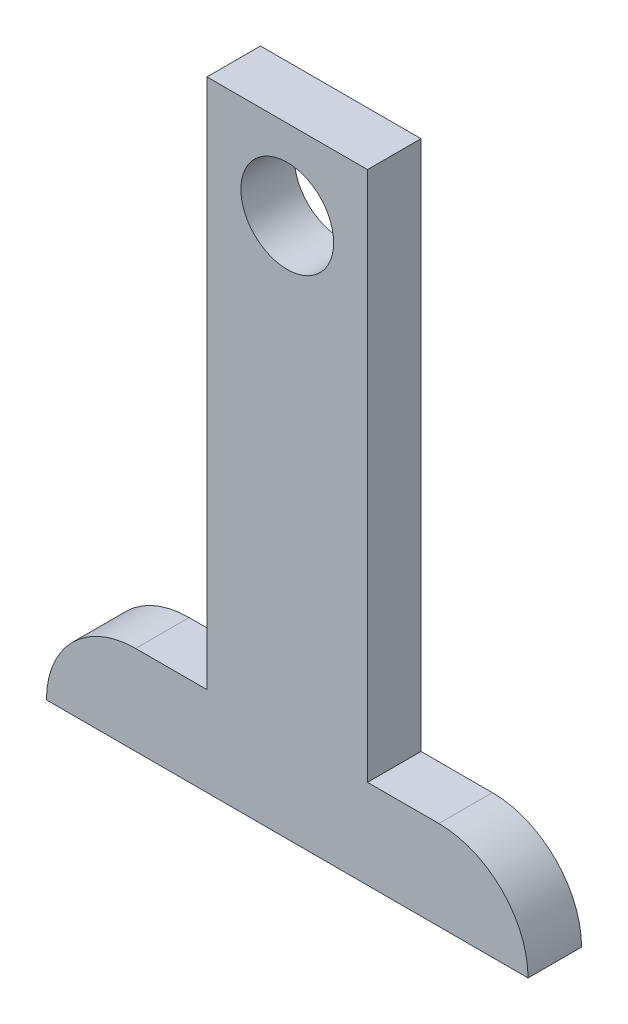
ISO-10303-21;
HEADER;
FILE_DESCRIPTION(('STEP AP214'),'2;1');
FILE_NAME('part.step','',(''),(''),'','','');
FILE_SCHEMA(('AUTOMOTIVE_DESIGN { 1 0 10303 214 1 1 1 1 }'));
ENDSEC;
DATA;
#1=APPLICATION_CONTEXT('core data for automotive mechanical design processes');
#2=APPLICATION_PROTOCOL_DEFINITION('international standard','automotive_design',2000,#1);
#3=PRODUCT_CONTEXT('',#1,'mechanical');
#4=PRODUCT('Part','Part','',(#3));
#5=PRODUCT_RELATED_PRODUCT_CATEGORY('part','',(#4));
#6=PRODUCT_DEFINITION_FORMATION('','',#4);
#7=PRODUCT_DEFINITION_CONTEXT('part definition',#1,'design');
#8=PRODUCT_DEFINITION('design','',#6,#7);
#9=PRODUCT_DEFINITION_SHAPE('','',#8);
#10=(LENGTH_UNIT() NAMED_UNIT(*) SI_UNIT(.MILLI.,.METRE.));
#11=(NAMED_UNIT(*) PLANE_ANGLE_UNIT() SI_UNIT($,.RADIAN.));
#12=(NAMED_UNIT(*) SI_UNIT($,.STERADIAN.) SOLID_ANGLE_UNIT());
#13=UNCERTAINTY_MEASURE_WITH_UNIT(LENGTH_MEASURE(1.E-05),#10,'distance_accuracy_value','');
#14=(GEOMETRIC_REPRESENTATION_CONTEXT(3) GLOBAL_UNCERTAINTY_ASSIGNED_CONTEXT((#13)) GLOBAL_UNIT_ASSIGNED_CONTEXT((#10,
#11,#12)) REPRESENTATION_CONTEXT('',''));
#15=CARTESIAN_POINT('',(0.,0.,0.));
#16=DIRECTION('',(0.,0.,1.));
#17=DIRECTION('',(1.,0.,0.));
#18=AXIS2_PLACEMENT_3D('',#15,#16,#17);
#19=CARTESIAN_POINT('',(0.,0.,3.));
#20=DIRECTION('',(0.,0.,-1.));
#21=DIRECTION('',(-1.,0.,0.));
#22=AXIS2_PLACEMENT_3D('',#19,#20,#21);
#23=PLANE('',#22);
#24=DIRECTION('',(1.,0.,0.));
#25=VECTOR('',#24,1.);
#26=CARTESIAN_POINT('',(-18.,-5.,3.));
#27=LINE('',#26,#25);
#28=CARTESIAN_POINT('',(-18.,-5.,3.));
#29=VERTEX_POINT('',#28);
#30=CARTESIAN_POINT('',(9.,-5.,3.));
#31=VERTEX_POINT('',#30);
#32=EDGE_CURVE('E142',#29,#31,#27,.T.);
#33=ORIENTED_EDGE('',*,*,#32,.T.);
#34=CARTESIAN_POINT('',(4.,-5.,3.));
#35=DIRECTION('',(0.,0.,-1.));
#36=DIRECTION('',(-1.,0.,0.));
#37=AXIS2_PLACEMENT_3D('',#34,#35,#36);
#38=CIRCLE('',#37,5.);
#39=CARTESIAN_POINT('',(4.,0.,3.));
#40=VERTEX_POINT('',#39);
#41=EDGE_CURVE('E11',#31,#40,#38,.F.);
#42=ORIENTED_EDGE('',*,*,#41,.T.);
#43=DIRECTION('',(-1.,0.,0.));
#44=VECTOR('',#43,1.);
#45=CARTESIAN_POINT('',(9.,0.,3.));
#46=LINE('',#45,#44);
#47=CARTESIAN_POINT('',(0.,0.,3.));
#48=VERTEX_POINT('',#47);
#49=EDGE_CURVE('E93',#40,#48,#46,.T.);
#50=ORIENTED_EDGE('',*,*,#49,.T.);
#51=DIRECTION('',(0.,1.,0.));
#52=VECTOR('',#51,1.);
#53=CARTESIAN_POINT('',(0.,0.,3.));
#54=LINE('',#53,#52);
#55=CARTESIAN_POINT('',(0.,29.75,3.));
#56=VERTEX_POINT('',#55);
#57=EDGE_CURVE('E96',#48,#56,#54,.T.);
#58=ORIENTED_EDGE('',*,*,#57,.T.);
#59=DIRECTION('',(-1.,0.,0.));
#60=VECTOR('',#59,1.);
#61=CARTESIAN_POINT('',(0.,29.75,3.));
#62=LINE('',#61,#60);
#63=CARTESIAN_POINT('',(-9.,29.75,3.));
#64=VERTEX_POINT('',#63);
#65=EDGE_CURVE('E109',#56,#64,#62,.T.);
#66=ORIENTED_EDGE('',*,*,#65,.T.);
#67=DIRECTION('',(0.,-1.,0.));
#68=VECTOR('',#67,1.);
#69=CARTESIAN_POINT('',(-9.,0.,3.));
#70=LINE('',#69,#68);
#71=CARTESIAN_POINT('',(-9.,0.,3.));
#72=VERTEX_POINT('',#71);
#73=EDGE_CURVE('E159',#64,#72,#70,.T.);
#74=ORIENTED_EDGE('',*,*,#73,.T.);
#75=DIRECTION('',(-1.,0.,0.));
#76=VECTOR('',#75,1.);
#77=CARTESIAN_POINT('',(-9.,0.,3.));
#78=LINE('',#77,#76);
#79=CARTESIAN_POINT('',(-13.,0.,3.));
#80=VERTEX_POINT('',#79);
#81=EDGE_CURVE('E146',#72,#80,#78,.T.);
#82=ORIENTED_EDGE('',*,*,#81,.T.);
#83=CARTESIAN_POINT('',(-13.,-5.,3.));
#84=DIRECTION('',(0.,0.,-1.));
#85=DIRECTION('',(-1.,0.,0.));
#86=AXIS2_PLACEMENT_3D('',#83,#84,#85);
#87=CIRCLE('',#86,5.);
#88=EDGE_CURVE('E124',#80,#29,#87,.F.);
#89=ORIENTED_EDGE('',*,*,#88,.T.);
#90=EDGE_LOOP('',(#33,#42,#50,#58,#66,#74,#82,#89));
#91=FACE_BOUND('',#90,.T.);
#92=CARTESIAN_POINT('',(-4.5,25.25,3.));
#93=DIRECTION('',(0.,0.,1.));
#94=DIRECTION('',(1.,0.,0.));
#95=AXIS2_PLACEMENT_3D('',#92,#93,#94);
#96=CIRCLE('',#95,2.6);
#97=CARTESIAN_POINT('',(-1.9,25.25,3.));
#98=VERTEX_POINT('',#97);
#99=EDGE_CURVE('E170',#98,#98,#96,.T.);
#100=ORIENTED_EDGE('',*,*,#99,.F.);
#101=EDGE_LOOP('',(#100));
#102=FACE_BOUND('',#101,.T.);
#103=ADVANCED_FACE('F33',(#91,#102),#23,.F.);
#104=CARTESIAN_POINT('',(0.,0.,0.));
#105=DIRECTION('',(0.,0.,-1.));
#106=DIRECTION('',(-1.,0.,0.));
#107=AXIS2_PLACEMENT_3D('',#104,#105,#106);
#108=PLANE('',#107);
#109=DIRECTION('',(-1.,0.,0.));
#110=VECTOR('',#109,1.);
#111=CARTESIAN_POINT('',(9.,0.,0.));
#112=LINE('',#111,#110);
#113=CARTESIAN_POINT('',(4.,0.,0.));
#114=VERTEX_POINT('',#113);
#115=CARTESIAN_POINT('',(0.,0.,0.));
#116=VERTEX_POINT('',#115);
#117=EDGE_CURVE('E113',#114,#116,#112,.T.);
#118=ORIENTED_EDGE('',*,*,#117,.F.);
#119=CARTESIAN_POINT('',(4.,-5.,0.));
#120=DIRECTION('',(0.,0.,-1.));
#121=DIRECTION('',(-1.,0.,0.));
#122=AXIS2_PLACEMENT_3D('',#119,#120,#121);
#123=CIRCLE('',#122,5.);
#124=CARTESIAN_POINT('',(9.,-5.,0.));
#125=VERTEX_POINT('',#124);
#126=EDGE_CURVE('E41',#114,#125,#123,.T.);
#127=ORIENTED_EDGE('',*,*,#126,.T.);
#128=DIRECTION('',(1.,0.,0.));
#129=VECTOR('',#128,1.);
#130=CARTESIAN_POINT('',(-18.,-5.,0.));
#131=LINE('',#130,#129);
#132=CARTESIAN_POINT('',(-18.,-5.,0.));
#133=VERTEX_POINT('',#132);
#134=EDGE_CURVE('E100',#133,#125,#131,.T.);
#135=ORIENTED_EDGE('',*,*,#134,.F.);
#136=CARTESIAN_POINT('',(-13.,-5.,0.));
#137=DIRECTION('',(0.,0.,-1.));
#138=DIRECTION('',(-1.,0.,0.));
#139=AXIS2_PLACEMENT_3D('',#136,#137,#138);
#140=CIRCLE('',#139,5.);
#141=CARTESIAN_POINT('',(-13.,0.,0.));
#142=VERTEX_POINT('',#141);
#143=EDGE_CURVE('E115',#133,#142,#140,.T.);
#144=ORIENTED_EDGE('',*,*,#143,.T.);
#145=DIRECTION('',(-1.,0.,0.));
#146=VECTOR('',#145,1.);
#147=CARTESIAN_POINT('',(-9.,0.,0.));
#148=LINE('',#147,#146);
#149=CARTESIAN_POINT('',(-9.,0.,0.));
#150=VERTEX_POINT('',#149);
#151=EDGE_CURVE('E140',#150,#142,#148,.T.);
#152=ORIENTED_EDGE('',*,*,#151,.F.);
#153=DIRECTION('',(0.,-1.,0.));
#154=VECTOR('',#153,1.);
#155=CARTESIAN_POINT('',(-9.,0.,0.));
#156=LINE('',#155,#154);
#157=CARTESIAN_POINT('',(-9.,29.75,0.));
#158=VERTEX_POINT('',#157);
#159=EDGE_CURVE('E158',#158,#150,#156,.T.);
#160=ORIENTED_EDGE('',*,*,#159,.F.);
#161=DIRECTION('',(-1.,0.,0.));
#162=VECTOR('',#161,1.);
#163=CARTESIAN_POINT('',(0.,29.75,0.));
#164=LINE('',#163,#162);
#165=CARTESIAN_POINT('',(0.,29.75,0.));
#166=VERTEX_POINT('',#165);
#167=EDGE_CURVE('E163',#166,#158,#164,.T.);
#168=ORIENTED_EDGE('',*,*,#167,.F.);
#169=DIRECTION('',(0.,1.,0.));
#170=VECTOR('',#169,1.);
#171=CARTESIAN_POINT('',(0.,0.,0.));
#172=LINE('',#171,#170);
#173=EDGE_CURVE('E166',#116,#166,#172,.T.);
#174=ORIENTED_EDGE('',*,*,#173,.F.);
#175=EDGE_LOOP('',(#118,#127,#135,#144,#152,#160,#168,#174));
#176=FACE_BOUND('',#175,.T.);
#177=CARTESIAN_POINT('',(-4.5,25.25,0.));
#178=DIRECTION('',(0.,0.,1.));
#179=DIRECTION('',(1.,0.,0.));
#180=AXIS2_PLACEMENT_3D('',#177,#178,#179);
#181=CIRCLE('',#180,2.6);
#182=CARTESIAN_POINT('',(-1.9,25.25,0.));
#183=VERTEX_POINT('',#182);
#184=EDGE_CURVE('E176',#183,#183,#181,.T.);
#185=ORIENTED_EDGE('',*,*,#184,.T.);
#186=EDGE_LOOP('',(#185));
#187=FACE_BOUND('',#186,.T.);
#188=ADVANCED_FACE('F130',(#176,#187),#108,.T.);
#189=CARTESIAN_POINT('',(9.,0.,3.));
#190=DIRECTION('',(0.,-1.,0.));
#191=DIRECTION('',(1.,0.,0.));
#192=AXIS2_PLACEMENT_3D('',#189,#190,#191);
#193=PLANE('',#192);
#194=ORIENTED_EDGE('',*,*,#49,.F.);
#195=DIRECTION('',(0.,0.,-1.));
#196=VECTOR('',#195,1.);
#197=CARTESIAN_POINT('',(4.,0.,3.));
#198=LINE('',#197,#196);
#199=EDGE_CURVE('E126',#40,#114,#198,.T.);
#200=ORIENTED_EDGE('',*,*,#199,.T.);
#201=ORIENTED_EDGE('',*,*,#117,.T.);
#202=DIRECTION('',(0.,0.,-1.));
#203=VECTOR('',#202,1.);
#204=CARTESIAN_POINT('',(0.,0.,3.));
#205=LINE('',#204,#203);
#206=EDGE_CURVE('E105',#48,#116,#205,.T.);
#207=ORIENTED_EDGE('',*,*,#206,.F.);
#208=EDGE_LOOP('',(#194,#200,#201,#207));
#209=FACE_BOUND('',#208,.T.);
#210=ADVANCED_FACE('F111',(#209),#193,.F.);
#211=CARTESIAN_POINT('',(0.,0.,3.));
#212=DIRECTION('',(-1.,0.,0.));
#213=DIRECTION('',(0.,0.,1.));
#214=AXIS2_PLACEMENT_3D('',#211,#212,#213);
#215=PLANE('',#214);
#216=ORIENTED_EDGE('',*,*,#173,.T.);
#217=DIRECTION('',(0.,0.,-1.));
#218=VECTOR('',#217,1.);
#219=CARTESIAN_POINT('',(0.,29.75,3.));
#220=LINE('',#219,#218);
#221=EDGE_CURVE('E107',#56,#166,#220,.T.);
#222=ORIENTED_EDGE('',*,*,#221,.F.);
#223=ORIENTED_EDGE('',*,*,#57,.F.);
#224=ORIENTED_EDGE('',*,*,#206,.T.);
#225=EDGE_LOOP('',(#216,#222,#223,#224));
#226=FACE_BOUND('',#225,.T.);
#227=ADVANCED_FACE('F104',(#226),#215,.F.);
#228=CARTESIAN_POINT('',(0.,29.75,3.));
#229=DIRECTION('',(0.,-1.,0.));
#230=DIRECTION('',(0.,0.,-1.));
#231=AXIS2_PLACEMENT_3D('',#228,#229,#230);
#232=PLANE('',#231);
#233=ORIENTED_EDGE('',*,*,#167,.T.);
#234=DIRECTION('',(0.,0.,-1.));
#235=VECTOR('',#234,1.);
#236=CARTESIAN_POINT('',(-9.,29.75,3.));
#237=LINE('',#236,#235);
#238=EDGE_CURVE('E119',#64,#158,#237,.T.);
#239=ORIENTED_EDGE('',*,*,#238,.F.);
#240=ORIENTED_EDGE('',*,*,#65,.F.);
#241=ORIENTED_EDGE('',*,*,#221,.T.);
#242=EDGE_LOOP('',(#233,#239,#240,#241));
#243=FACE_BOUND('',#242,.T.);
#244=ADVANCED_FACE('F200',(#243),#232,.F.);
#245=CARTESIAN_POINT('',(-9.,0.,3.));
#246=DIRECTION('',(1.,0.,0.));
#247=DIRECTION('',(0.,0.,-1.));
#248=AXIS2_PLACEMENT_3D('',#245,#246,#247);
#249=PLANE('',#248);
#250=ORIENTED_EDGE('',*,*,#159,.T.);
#251=DIRECTION('',(0.,0.,-1.));
#252=VECTOR('',#251,1.);
#253=CARTESIAN_POINT('',(-9.,0.,3.));
#254=LINE('',#253,#252);
#255=EDGE_CURVE('E144',#72,#150,#254,.T.);
#256=ORIENTED_EDGE('',*,*,#255,.F.);
#257=ORIENTED_EDGE('',*,*,#73,.F.);
#258=ORIENTED_EDGE('',*,*,#238,.T.);
#259=EDGE_LOOP('',(#250,#256,#257,#258));
#260=FACE_BOUND('',#259,.T.);
#261=ADVANCED_FACE('F156',(#260),#249,.F.);
#262=CARTESIAN_POINT('',(-9.,0.,3.));
#263=DIRECTION('',(0.,-1.,0.));
#264=DIRECTION('',(1.,0.,0.));
#265=AXIS2_PLACEMENT_3D('',#262,#263,#264);
#266=PLANE('',#265);
#267=ORIENTED_EDGE('',*,*,#151,.T.);
#268=DIRECTION('',(0.,0.,-1.));
#269=VECTOR('',#268,1.);
#270=CARTESIAN_POINT('',(-13.,0.,3.));
#271=LINE('',#270,#269);
#272=EDGE_CURVE('E117',#142,#80,#271,.F.);
#273=ORIENTED_EDGE('',*,*,#272,.T.);
#274=ORIENTED_EDGE('',*,*,#81,.F.);
#275=ORIENTED_EDGE('',*,*,#255,.T.);
#276=EDGE_LOOP('',(#267,#273,#274,#275));
#277=FACE_BOUND('',#276,.T.);
#278=ADVANCED_FACE('F194',(#277),#266,.F.);
#279=CARTESIAN_POINT('',(-18.,-5.,3.));
#280=DIRECTION('',(0.,1.,0.));
#281=DIRECTION('',(0.,0.,1.));
#282=AXIS2_PLACEMENT_3D('',#279,#280,#281);
#283=PLANE('',#282);
#284=ORIENTED_EDGE('',*,*,#134,.T.);
#285=DIRECTION('',(0.,0.,-1.));
#286=VECTOR('',#285,1.);
#287=CARTESIAN_POINT('',(9.,-5.,3.));
#288=LINE('',#287,#286);
#289=EDGE_CURVE('E137',#31,#125,#288,.T.);
#290=ORIENTED_EDGE('',*,*,#289,.F.);
#291=ORIENTED_EDGE('',*,*,#32,.F.);
#292=DIRECTION('',(0.,0.,-1.));
#293=VECTOR('',#292,1.);
#294=CARTESIAN_POINT('',(-18.,-5.,3.));
#295=LINE('',#294,#293);
#296=EDGE_CURVE('E139',#29,#133,#295,.T.);
#297=ORIENTED_EDGE('',*,*,#296,.T.);
#298=EDGE_LOOP('',(#284,#290,#291,#297));
#299=FACE_BOUND('',#298,.T.);
#300=ADVANCED_FACE('F135',(#299),#283,.F.);
#301=CARTESIAN_POINT('',(-4.5,25.25,3.));
#302=DIRECTION('',(0.,0.,-1.));
#303=DIRECTION('',(-1.,0.,0.));
#304=AXIS2_PLACEMENT_3D('',#301,#302,#303);
#305=CYLINDRICAL_SURFACE('',#304,2.6);
#306=ORIENTED_EDGE('',*,*,#99,.T.);
#307=EDGE_LOOP('',(#306));
#308=FACE_BOUND('',#307,.T.);
#309=ORIENTED_EDGE('',*,*,#184,.F.);
#310=EDGE_LOOP('',(#309));
#311=FACE_BOUND('',#310,.T.);
#312=ADVANCED_FACE('F182',(#308,#311),#305,.F.);
#313=CARTESIAN_POINT('',(-13.,-5.,3.));
#314=DIRECTION('',(0.,0.,-1.));
#315=DIRECTION('',(-1.,0.,0.));
#316=AXIS2_PLACEMENT_3D('',#313,#314,#315);
#317=CYLINDRICAL_SURFACE('',#316,5.);
#318=ORIENTED_EDGE('',*,*,#88,.F.);
#319=ORIENTED_EDGE('',*,*,#272,.F.);
#320=ORIENTED_EDGE('',*,*,#143,.F.);
#321=ORIENTED_EDGE('',*,*,#296,.F.);
#322=EDGE_LOOP('',(#318,#319,#320,#321));
#323=FACE_BOUND('',#322,.T.);
#324=ADVANCED_FACE('F206',(#323),#317,.T.);
#325=CARTESIAN_POINT('',(4.,-5.,3.));
#326=DIRECTION('',(0.,0.,-1.));
#327=DIRECTION('',(-1.,0.,0.));
#328=AXIS2_PLACEMENT_3D('',#325,#326,#327);
#329=CYLINDRICAL_SURFACE('',#328,5.);
#330=ORIENTED_EDGE('',*,*,#41,.F.);
#331=ORIENTED_EDGE('',*,*,#289,.T.);
#332=ORIENTED_EDGE('',*,*,#126,.F.);
#333=ORIENTED_EDGE('',*,*,#199,.F.);
#334=EDGE_LOOP('',(#330,#331,#332,#333));
#335=FACE_BOUND('',#334,.T.);
#336=ADVANCED_FACE('F35',(#335),#329,.T.);
#337=CLOSED_SHELL('',(#103,#188,#210,#227,#244,#261,#278,#300,#312,#324,#336));
#338=MANIFOLD_SOLID_BREP('B2',#337);
#339=ADVANCED_BREP_SHAPE_REPRESENTATION('',(#18,#338),#14);
#340=SHAPE_DEFINITION_REPRESENTATION(#9,#339);
ENDSEC;
END-ISO-10303-21;
